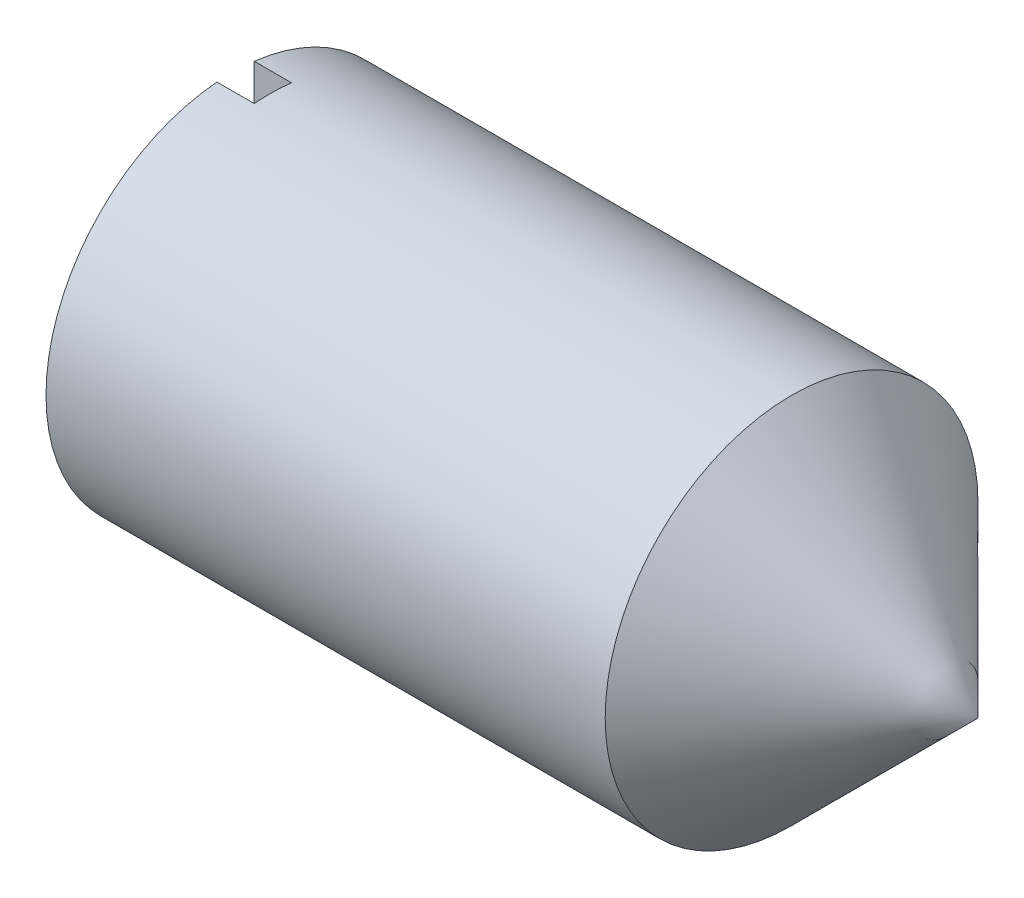
ISO-10303-21;
HEADER;
FILE_DESCRIPTION(('STEP AP214'),'2;1');
FILE_NAME('part.step','',(''),(''),'','','');
FILE_SCHEMA(('AUTOMOTIVE_DESIGN { 1 0 10303 214 1 1 1 1 }'));
ENDSEC;
DATA;
#1=APPLICATION_CONTEXT('core data for automotive mechanical design processes');
#2=APPLICATION_PROTOCOL_DEFINITION('international standard','automotive_design',2000,#1);
#3=PRODUCT_CONTEXT('',#1,'mechanical');
#4=PRODUCT('Part','Part','',(#3));
#5=PRODUCT_RELATED_PRODUCT_CATEGORY('part','',(#4));
#6=PRODUCT_DEFINITION_FORMATION('','',#4);
#7=PRODUCT_DEFINITION_CONTEXT('part definition',#1,'design');
#8=PRODUCT_DEFINITION('design','',#6,#7);
#9=PRODUCT_DEFINITION_SHAPE('','',#8);
#10=(LENGTH_UNIT() NAMED_UNIT(*) SI_UNIT(.MILLI.,.METRE.));
#11=(NAMED_UNIT(*) PLANE_ANGLE_UNIT() SI_UNIT($,.RADIAN.));
#12=(NAMED_UNIT(*) SI_UNIT($,.STERADIAN.) SOLID_ANGLE_UNIT());
#13=UNCERTAINTY_MEASURE_WITH_UNIT(LENGTH_MEASURE(1.E-05),#10,'distance_accuracy_value','');
#14=(GEOMETRIC_REPRESENTATION_CONTEXT(3) GLOBAL_UNCERTAINTY_ASSIGNED_CONTEXT((#13)) GLOBAL_UNIT_ASSIGNED_CONTEXT((#10,
#11,#12)) REPRESENTATION_CONTEXT('',''));
#15=CARTESIAN_POINT('',(0.,0.,0.));
#16=DIRECTION('',(0.,0.,1.));
#17=DIRECTION('',(1.,0.,0.));
#18=AXIS2_PLACEMENT_3D('',#15,#16,#17);
#19=CARTESIAN_POINT('',(0.,0.,0.));
#20=DIRECTION('',(-1.,0.,0.));
#21=DIRECTION('',(0.,0.,1.));
#22=AXIS2_PLACEMENT_3D('',#19,#20,#21);
#23=PLANE('',#22);
#24=DIRECTION('',(0.,-1.,0.));
#25=VECTOR('',#24,1.);
#26=CARTESIAN_POINT('',(0.,0.,2.24248664650001));
#27=LINE('',#26,#25);
#28=CARTESIAN_POINT('',(0.,2.52251576892776,2.24248664650001));
#29=VERTEX_POINT('',#28);
#30=CARTESIAN_POINT('',(0.,-2.52251576892775,2.24248664650001));
#31=VERTEX_POINT('',#30);
#32=EDGE_CURVE('E81',#29,#31,#27,.T.);
#33=ORIENTED_EDGE('',*,*,#32,.F.);
#34=CARTESIAN_POINT('',(0.,0.,2.54));
#35=DIRECTION('',(1.,0.,0.));
#36=DIRECTION('',(0.,0.,-1.));
#37=AXIS2_PLACEMENT_3D('',#34,#35,#36);
#38=CIRCLE('',#37,2.54);
#39=EDGE_CURVE('E94',#31,#29,#38,.T.);
#40=ORIENTED_EDGE('',*,*,#39,.F.);
#41=EDGE_LOOP('',(#33,#40));
#42=FACE_BOUND('',#41,.T.);
#43=ADVANCED_FACE('F35',(#42),#23,.T.);
#44=CARTESIAN_POINT('',(10.16,0.,2.54000000000005));
#45=DIRECTION('',(-1.,0.,0.));
#46=DIRECTION('',(0.,0.,1.));
#47=AXIS2_PLACEMENT_3D('',#44,#45,#46);
#48=CONICAL_SURFACE('',#47,0.,0.785398163397453);
#49=CARTESIAN_POINT('',(7.61999999999999,0.,2.54000000000004));
#50=DIRECTION('',(1.,0.,0.));
#51=DIRECTION('',(0.,0.,-1.));
#52=AXIS2_PLACEMENT_3D('',#49,#50,#51);
#53=CIRCLE('',#52,2.54000000000004);
#54=CARTESIAN_POINT('',(7.62,0.,0.));
#55=VERTEX_POINT('',#54);
#56=EDGE_CURVE('E82',#55,#55,#53,.T.);
#57=ORIENTED_EDGE('',*,*,#56,.T.);
#58=EDGE_LOOP('',(#57));
#59=FACE_BOUND('',#58,.T.);
#60=CARTESIAN_POINT('',(10.16,0.,2.54000000000005));
#61=VERTEX_POINT('',#60);
#62=VERTEX_LOOP('',#61);
#63=FACE_BOUND('',#62,.T.);
#64=ADVANCED_FACE('F37',(#59,#63),#48,.T.);
#65=CARTESIAN_POINT('',(10.16,0.,2.54000000000005));
#66=DIRECTION('',(1.,0.,0.));
#67=DIRECTION('',(0.,0.,-1.));
#68=AXIS2_PLACEMENT_3D('',#65,#66,#67);
#69=CYLINDRICAL_SURFACE('',#68,2.54000000000002);
#70=ORIENTED_EDGE('',*,*,#39,.T.);
#71=DIRECTION('',(1.,0.,0.));
#72=VECTOR('',#71,1.);
#73=CARTESIAN_POINT('',(10.16,2.52251576892778,2.24248664650005));
#74=LINE('',#73,#72);
#75=CARTESIAN_POINT('',(0.507999999999989,2.52251576892777,2.24248664650001));
#76=VERTEX_POINT('',#75);
#77=EDGE_CURVE('E98',#29,#76,#74,.T.);
#78=ORIENTED_EDGE('',*,*,#77,.T.);
#79=CARTESIAN_POINT('',(0.507999999999988,0.,2.54));
#80=DIRECTION('',(-1.,0.,0.));
#81=DIRECTION('',(0.,0.,1.));
#82=AXIS2_PLACEMENT_3D('',#79,#80,#81);
#83=CIRCLE('',#82,2.54000000000002);
#84=CARTESIAN_POINT('',(0.507999999999987,2.53126359189344,2.75048664650001));
#85=VERTEX_POINT('',#84);
#86=EDGE_CURVE('E11',#85,#76,#83,.T.);
#87=ORIENTED_EDGE('',*,*,#86,.F.);
#88=DIRECTION('',(1.,0.,0.));
#89=VECTOR('',#88,1.);
#90=CARTESIAN_POINT('',(10.16,2.53126359189344,2.75048664650005));
#91=LINE('',#90,#89);
#92=CARTESIAN_POINT('',(0.,2.53126359189342,2.75048664650001));
#93=VERTEX_POINT('',#92);
#94=EDGE_CURVE('E76',#85,#93,#91,.F.);
#95=ORIENTED_EDGE('',*,*,#94,.T.);
#96=CARTESIAN_POINT('',(0.,-2.53126359189342,2.75048664650001));
#97=VERTEX_POINT('',#96);
#98=EDGE_CURVE('E89',#93,#97,#38,.T.);
#99=ORIENTED_EDGE('',*,*,#98,.T.);
#100=DIRECTION('',(1.,0.,0.));
#101=VECTOR('',#100,1.);
#102=CARTESIAN_POINT('',(10.16,-2.53126359189344,2.75048664650006));
#103=LINE('',#102,#101);
#104=CARTESIAN_POINT('',(0.507999999999987,-2.53126359189344,2.75048664650001));
#105=VERTEX_POINT('',#104);
#106=EDGE_CURVE('E50',#97,#105,#103,.T.);
#107=ORIENTED_EDGE('',*,*,#106,.T.);
#108=CARTESIAN_POINT('',(0.507999999999989,-2.52251576892777,2.24248664650001));
#109=VERTEX_POINT('',#108);
#110=EDGE_CURVE('E39',#109,#105,#83,.T.);
#111=ORIENTED_EDGE('',*,*,#110,.F.);
#112=DIRECTION('',(1.,0.,0.));
#113=VECTOR('',#112,1.);
#114=CARTESIAN_POINT('',(10.16,-2.52251576892778,2.24248664650006));
#115=LINE('',#114,#113);
#116=EDGE_CURVE('E111',#109,#31,#115,.F.);
#117=ORIENTED_EDGE('',*,*,#116,.T.);
#118=EDGE_LOOP('',(#70,#78,#87,#95,#99,#107,#111,#117));
#119=FACE_BOUND('',#118,.T.);
#120=ORIENTED_EDGE('',*,*,#56,.F.);
#121=EDGE_LOOP('',(#120));
#122=FACE_BOUND('',#121,.T.);
#123=ADVANCED_FACE('F87',(#119,#122),#69,.T.);
#124=DIRECTION('',(0.,1.,0.));
#125=VECTOR('',#124,1.);
#126=CARTESIAN_POINT('',(0.,0.,2.75048664650001));
#127=LINE('',#126,#125);
#128=EDGE_CURVE('E73',#97,#93,#127,.T.);
#129=ORIENTED_EDGE('',*,*,#128,.F.);
#130=ORIENTED_EDGE('',*,*,#98,.F.);
#131=EDGE_LOOP('',(#129,#130));
#132=FACE_BOUND('',#131,.T.);
#133=ADVANCED_FACE('F93',(#132),#23,.T.);
#134=CARTESIAN_POINT('',(0.508,0.,0.));
#135=DIRECTION('',(-1.,0.,0.));
#136=DIRECTION('',(0.,0.,1.));
#137=AXIS2_PLACEMENT_3D('',#134,#135,#136);
#138=PLANE('',#137);
#139=ORIENTED_EDGE('',*,*,#86,.T.);
#140=DIRECTION('',(0.,-1.,0.));
#141=VECTOR('',#140,1.);
#142=CARTESIAN_POINT('',(0.507999999999989,2.69650413787155,2.24248664650001));
#143=LINE('',#142,#141);
#144=EDGE_CURVE('E109',#76,#109,#143,.T.);
#145=ORIENTED_EDGE('',*,*,#144,.T.);
#146=ORIENTED_EDGE('',*,*,#110,.T.);
#147=DIRECTION('',(0.,1.,0.));
#148=VECTOR('',#147,1.);
#149=CARTESIAN_POINT('',(0.507999999999987,2.69650413787155,2.75048664650001));
#150=LINE('',#149,#148);
#151=EDGE_CURVE('E91',#105,#85,#150,.T.);
#152=ORIENTED_EDGE('',*,*,#151,.T.);
#153=EDGE_LOOP('',(#139,#145,#146,#152));
#154=FACE_BOUND('',#153,.T.);
#155=ADVANCED_FACE('F107',(#154),#138,.T.);
#156=CARTESIAN_POINT('',(0.507999999999989,2.69650413787155,2.24248664650001));
#157=DIRECTION('',(0.,0.,-1.));
#158=DIRECTION('',(-1.,0.,0.));
#159=AXIS2_PLACEMENT_3D('',#156,#157,#158);
#160=PLANE('',#159);
#161=ORIENTED_EDGE('',*,*,#32,.T.);
#162=ORIENTED_EDGE('',*,*,#116,.F.);
#163=ORIENTED_EDGE('',*,*,#144,.F.);
#164=ORIENTED_EDGE('',*,*,#77,.F.);
#165=EDGE_LOOP('',(#161,#162,#163,#164));
#166=FACE_BOUND('',#165,.T.);
#167=ADVANCED_FACE('F115',(#166),#160,.F.);
#168=CARTESIAN_POINT('',(0.507999999999987,2.69650413787155,2.75048664650001));
#169=DIRECTION('',(0.,0.,1.));
#170=DIRECTION('',(1.,0.,0.));
#171=AXIS2_PLACEMENT_3D('',#168,#169,#170);
#172=PLANE('',#171);
#173=ORIENTED_EDGE('',*,*,#128,.T.);
#174=ORIENTED_EDGE('',*,*,#94,.F.);
#175=ORIENTED_EDGE('',*,*,#151,.F.);
#176=ORIENTED_EDGE('',*,*,#106,.F.);
#177=EDGE_LOOP('',(#173,#174,#175,#176));
#178=FACE_BOUND('',#177,.T.);
#179=ADVANCED_FACE('F75',(#178),#172,.F.);
#180=CLOSED_SHELL('',(#43,#64,#123,#133,#155,#167,#179));
#181=MANIFOLD_SOLID_BREP('B2',#180);
#182=ADVANCED_BREP_SHAPE_REPRESENTATION('',(#18,#181),#14);
#183=SHAPE_DEFINITION_REPRESENTATION(#9,#182);
ENDSEC;
END-ISO-10303-21;
